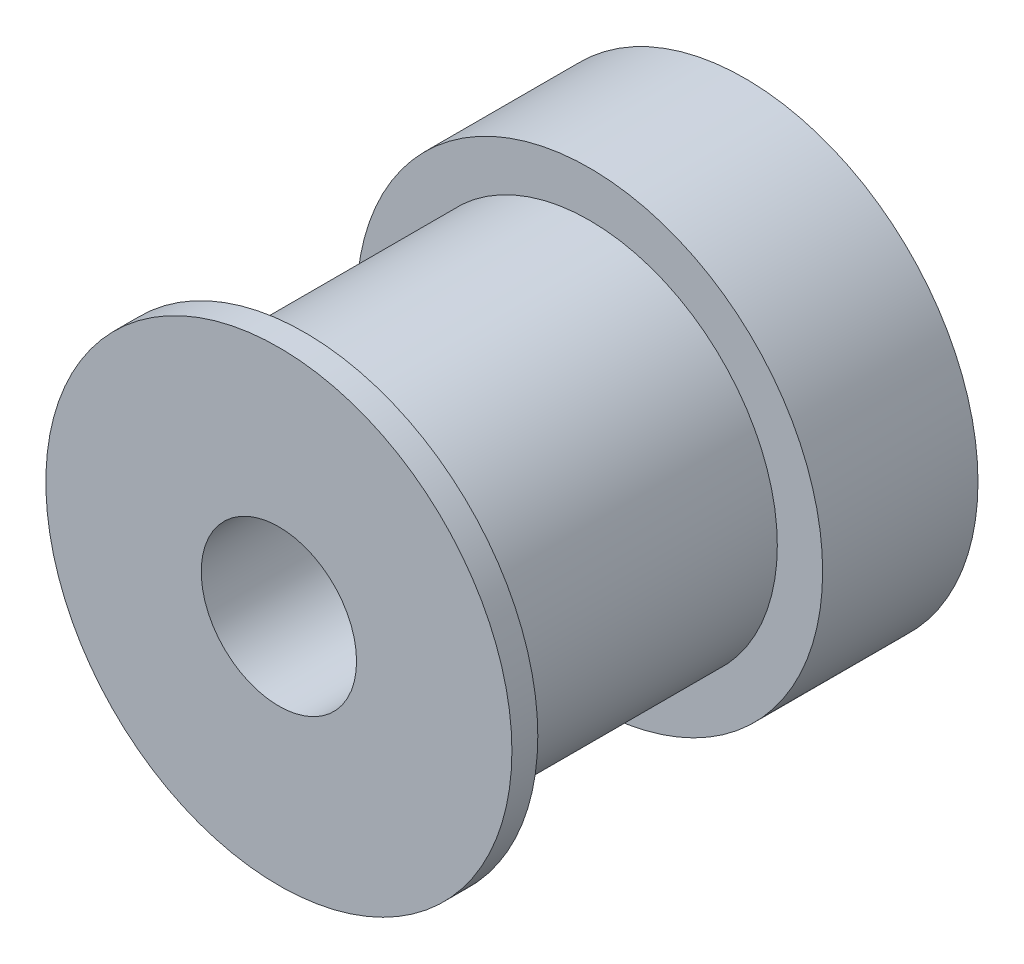
ISO-10303-21;
HEADER;
FILE_DESCRIPTION(('STEP AP214'),'2;1');
FILE_NAME('part.step','',(''),(''),'','','');
FILE_SCHEMA(('AUTOMOTIVE_DESIGN { 1 0 10303 214 1 1 1 1 }'));
ENDSEC;
DATA;
#1=APPLICATION_CONTEXT('core data for automotive mechanical design processes');
#2=APPLICATION_PROTOCOL_DEFINITION('international standard','automotive_design',2000,#1);
#3=PRODUCT_CONTEXT('',#1,'mechanical');
#4=PRODUCT('Part','Part','',(#3));
#5=PRODUCT_RELATED_PRODUCT_CATEGORY('part','',(#4));
#6=PRODUCT_DEFINITION_FORMATION('','',#4);
#7=PRODUCT_DEFINITION_CONTEXT('part definition',#1,'design');
#8=PRODUCT_DEFINITION('design','',#6,#7);
#9=PRODUCT_DEFINITION_SHAPE('','',#8);
#10=(LENGTH_UNIT() NAMED_UNIT(*) SI_UNIT(.MILLI.,.METRE.));
#11=(NAMED_UNIT(*) PLANE_ANGLE_UNIT() SI_UNIT($,.RADIAN.));
#12=(NAMED_UNIT(*) SI_UNIT($,.STERADIAN.) SOLID_ANGLE_UNIT());
#13=UNCERTAINTY_MEASURE_WITH_UNIT(LENGTH_MEASURE(1.E-05),#10,'distance_accuracy_value','');
#14=(GEOMETRIC_REPRESENTATION_CONTEXT(3) GLOBAL_UNCERTAINTY_ASSIGNED_CONTEXT((#13)) GLOBAL_UNIT_ASSIGNED_CONTEXT((#10,
#11,#12)) REPRESENTATION_CONTEXT('',''));
#15=CARTESIAN_POINT('',(0.,0.,0.));
#16=DIRECTION('',(0.,0.,1.));
#17=DIRECTION('',(1.,0.,0.));
#18=AXIS2_PLACEMENT_3D('',#15,#16,#17);
#19=CARTESIAN_POINT('',(0.,0.,6.));
#20=DIRECTION('',(0.,0.,1.));
#21=DIRECTION('',(1.,0.,0.));
#22=AXIS2_PLACEMENT_3D('',#19,#20,#21);
#23=PLANE('',#22);
#24=CARTESIAN_POINT('',(0.,0.,6.));
#25=DIRECTION('',(0.,0.,1.));
#26=DIRECTION('',(1.,0.,0.));
#27=AXIS2_PLACEMENT_3D('',#24,#25,#26);
#28=CIRCLE('',#27,7.25);
#29=CARTESIAN_POINT('',(7.25,0.,6.));
#30=VERTEX_POINT('',#29);
#31=EDGE_CURVE('E10',#30,#30,#28,.T.);
#32=ORIENTED_EDGE('',*,*,#31,.F.);
#33=EDGE_LOOP('',(#32));
#34=FACE_BOUND('',#33,.T.);
#35=CARTESIAN_POINT('',(0.,0.,6.));
#36=DIRECTION('',(0.,0.,1.));
#37=DIRECTION('',(1.,0.,0.));
#38=AXIS2_PLACEMENT_3D('',#35,#36,#37);
#39=CIRCLE('',#38,9.);
#40=CARTESIAN_POINT('',(9.,0.,6.));
#41=VERTEX_POINT('',#40);
#42=EDGE_CURVE('E48',#41,#41,#39,.T.);
#43=ORIENTED_EDGE('',*,*,#42,.T.);
#44=EDGE_LOOP('',(#43));
#45=FACE_BOUND('',#44,.T.);
#46=ADVANCED_FACE('F34',(#34,#45),#23,.T.);
#47=CARTESIAN_POINT('',(0.,0.,0.));
#48=DIRECTION('',(0.,0.,1.));
#49=DIRECTION('',(1.,0.,0.));
#50=AXIS2_PLACEMENT_3D('',#47,#48,#49);
#51=PLANE('',#50);
#52=CARTESIAN_POINT('',(0.,0.,0.));
#53=DIRECTION('',(0.,0.,1.));
#54=DIRECTION('',(1.,0.,0.));
#55=AXIS2_PLACEMENT_3D('',#52,#53,#54);
#56=CIRCLE('',#55,9.);
#57=CARTESIAN_POINT('',(9.,0.,0.));
#58=VERTEX_POINT('',#57);
#59=EDGE_CURVE('E53',#58,#58,#56,.T.);
#60=ORIENTED_EDGE('',*,*,#59,.F.);
#61=EDGE_LOOP('',(#60));
#62=FACE_BOUND('',#61,.T.);
#63=CARTESIAN_POINT('',(0.,0.,0.));
#64=DIRECTION('',(0.,0.,1.));
#65=DIRECTION('',(1.,0.,0.));
#66=AXIS2_PLACEMENT_3D('',#63,#64,#65);
#67=CIRCLE('',#66,3.);
#68=CARTESIAN_POINT('',(3.,0.,0.));
#69=VERTEX_POINT('',#68);
#70=EDGE_CURVE('E59',#69,#69,#67,.T.);
#71=ORIENTED_EDGE('',*,*,#70,.T.);
#72=EDGE_LOOP('',(#71));
#73=FACE_BOUND('',#72,.T.);
#74=ADVANCED_FACE('F65',(#62,#73),#51,.F.);
#75=CARTESIAN_POINT('',(0.,0.,6.));
#76=DIRECTION('',(0.,0.,-1.));
#77=DIRECTION('',(-1.,0.,0.));
#78=AXIS2_PLACEMENT_3D('',#75,#76,#77);
#79=CYLINDRICAL_SURFACE('',#78,9.);
#80=CARTESIAN_POINT('',(0.,-9.,5.5));
#81=CARTESIAN_POINT('',(0.0836345429749289,-8.99999856701294,5.49999664663131));
#82=CARTESIAN_POINT('',(0.167314729103293,-8.9988220674782,5.49298163501865));
#83=CARTESIAN_POINT('',(0.332328133003826,-8.99424206964832,5.46511860474081));
#84=CARTESIAN_POINT('',(0.413659120775548,-8.99083652354334,5.44425786585304));
#85=CARTESIAN_POINT('',(0.571562848327586,-8.9821804094187,5.38935073084435));
#86=CARTESIAN_POINT('',(0.64813942105914,-8.97693135095516,5.35531512061566));
#87=CARTESIAN_POINT('',(0.794485105186767,-8.96516536249242,5.27505262476856));
#88=CARTESIAN_POINT('',(0.864254993927155,-8.9586485775266,5.2288271335102));
#89=CARTESIAN_POINT('',(0.995683568575009,-8.94499990474988,5.12502694970772));
#90=CARTESIAN_POINT('',(1.05726774212098,-8.93786323088914,5.06735853121832));
#91=CARTESIAN_POINT('',(1.16993309919596,-8.92381576126039,4.94251121891631));
#92=CARTESIAN_POINT('',(1.22101361963458,-8.916904979776,4.87533172512603));
#93=CARTESIAN_POINT('',(1.31152027536308,-8.90404539455868,4.73285742028177));
#94=CARTESIAN_POINT('',(1.3508727317166,-8.89810277454982,4.65751519791714));
#95=CARTESIAN_POINT('',(1.41633501924673,-8.88791873876805,4.50117426141962));
#96=CARTESIAN_POINT('',(1.44244574493937,-8.88367720808584,4.42017592979342));
#97=CARTESIAN_POINT('',(1.48044862667088,-8.87742322105653,4.25561183508608));
#98=CARTESIAN_POINT('',(1.49246941748124,-8.8753906109142,4.17207655809916));
#99=CARTESIAN_POINT('',(1.50235003517393,-8.87372363361989,4.00415183386992));
#100=CARTESIAN_POINT('',(1.5002108642334,-8.87408909674328,3.91976244749962));
#101=CARTESIAN_POINT('',(1.48193705903769,-8.87715857318133,3.75344328323473));
#102=CARTESIAN_POINT('',(1.46594692913386,-8.8798384399135,3.67149711787286));
#103=CARTESIAN_POINT('',(1.42065188424207,-8.88719697126605,3.51146720930252));
#104=CARTESIAN_POINT('',(1.39134651259184,-8.89187570443963,3.43338359866687));
#105=CARTESIAN_POINT('',(1.32010634765635,-8.9027308760046,3.28286270593545));
#106=CARTESIAN_POINT('',(1.27811154832783,-8.90891440264395,3.21045435635126));
#107=CARTESIAN_POINT('',(1.18272721053446,-8.92207751049005,3.07365735967697));
#108=CARTESIAN_POINT('',(1.12933675239257,-8.92905715592572,3.00926936052704));
#109=CARTESIAN_POINT('',(1.01188932729543,-8.94313216727871,2.88950434851559));
#110=CARTESIAN_POINT('',(0.947708378323875,-8.95022789538991,2.83424888887595));
#111=CARTESIAN_POINT('',(0.810921149388987,-8.96365560838034,2.7352733424008));
#112=CARTESIAN_POINT('',(0.738314815143852,-8.96998758833847,2.69155332989006));
#113=CARTESIAN_POINT('',(0.586623549700026,-8.98118335735747,2.61687866371823));
#114=CARTESIAN_POINT('',(0.507533235338796,-8.98604591044468,2.58593474840125));
#115=CARTESIAN_POINT('',(0.345179007361638,-8.99374501807596,2.53780347085241));
#116=CARTESIAN_POINT('',(0.26191544350768,-8.99658174210284,2.52061495781577));
#117=CARTESIAN_POINT('',(0.0946259407809733,-8.99988677905612,2.50064718492332));
#118=CARTESIAN_POINT('',(0.010620442290606,-9.00038251807671,2.49770105691664));
#119=CARTESIAN_POINT('',(-0.156683863733933,-8.99902484652702,2.50585680665687));
#120=CARTESIAN_POINT('',(-0.239982698335224,-8.99717152634471,2.51695814388024));
#121=CARTESIAN_POINT('',(-0.402993705328059,-8.99134096162921,2.55275490960129));
#122=CARTESIAN_POINT('',(-0.482724521031229,-8.98737662880787,2.57736772503408));
#123=CARTESIAN_POINT('',(-0.636928130916266,-8.97776678673215,2.63940071091972));
#124=CARTESIAN_POINT('',(-0.711400629545832,-8.97212118307212,2.67682160058116));
#125=CARTESIAN_POINT('',(-0.853698413681376,-8.95970709781444,2.76379067481807));
#126=CARTESIAN_POINT('',(-0.92145915056229,-8.95292913532213,2.81344309370035));
#127=CARTESIAN_POINT('',(-1.04774615130161,-8.93903080435141,2.92332238923104));
#128=CARTESIAN_POINT('',(-1.10627174381795,-8.93191041102928,2.983550033966));
#129=CARTESIAN_POINT('',(-1.2130456677948,-8.91804105141507,3.11361852884285));
#130=CARTESIAN_POINT('',(-1.26118125666823,-8.91129669682264,3.18355249930865));
#131=CARTESIAN_POINT('',(-1.34502138617699,-8.8990291786673,3.33061178148312));
#132=CARTESIAN_POINT('',(-1.38072632086189,-8.89350597639612,3.4077368651365));
#133=CARTESIAN_POINT('',(-1.43852299888389,-8.88434072218623,3.56667383968728));
#134=CARTESIAN_POINT('',(-1.46067085952877,-8.88069092586639,3.64846485701829));
#135=CARTESIAN_POINT('',(-1.49090127226697,-8.87566630101156,3.81467207753306));
#136=CARTESIAN_POINT('',(-1.4989850471677,-8.87429127469633,3.89908805183923));
#137=CARTESIAN_POINT('',(-1.50082371962841,-8.87398039850407,4.06702309957745));
#138=CARTESIAN_POINT('',(-1.49475608167511,-8.8750143390339,4.15054022714517));
#139=CARTESIAN_POINT('',(-1.46884790337411,-8.87933868872237,4.31534754883046));
#140=CARTESIAN_POINT('',(-1.44900740766749,-8.88262909056728,4.39663775016512));
#141=CARTESIAN_POINT('',(-1.39618469375694,-8.89108413769031,4.55461506237557));
#142=CARTESIAN_POINT('',(-1.36321775436026,-8.89624660331802,4.63130740603362));
#143=CARTESIAN_POINT('',(-1.28509620234954,-8.90786621353324,4.77810140151691));
#144=CARTESIAN_POINT('',(-1.23994098524914,-8.91432342233039,4.84820272622328));
#145=CARTESIAN_POINT('',(-1.13809133062329,-8.92790072427373,4.98072134986465));
#146=CARTESIAN_POINT('',(-1.08126633815619,-8.93502777345781,5.04303761002017));
#147=CARTESIAN_POINT('',(-0.957965418828137,-8.94908623416505,5.15731096268496));
#148=CARTESIAN_POINT('',(-0.891487267747581,-8.95601760015928,5.2092656611829));
#149=CARTESIAN_POINT('',(-0.750221501784168,-8.96895917785332,5.30166896091997));
#150=CARTESIAN_POINT('',(-0.67537967251969,-8.97496269751862,5.34203562358777));
#151=CARTESIAN_POINT('',(-0.519907841627388,-8.98530700561065,5.40956169076595));
#152=CARTESIAN_POINT('',(-0.439283696898005,-8.98964944906489,5.43673424864782));
#153=CARTESIAN_POINT('',(-0.29862198602724,-8.99523474499773,5.471203164476));
#154=CARTESIAN_POINT('',(-0.239435298179068,-8.99701216364015,5.48198468176958));
#155=CARTESIAN_POINT('',(-0.120173586191886,-8.99939529591672,5.49638424270685));
#156=CARTESIAN_POINT('',(-0.0600985773650966,-9.00000102972385,5.50000240968242));
#157=CARTESIAN_POINT('',(0.,-9.,5.5));
#158=B_SPLINE_CURVE_WITH_KNOTS('',3,(#80,#81,#82,#83,#84,#85,#86,#87,#88,#89,#90,#91,#92,#93,
#94,#95,#96,#97,#98,#99,#100,#101,#102,#103,#104,#105,#106,#107,#108,#109,#110,#111,#112,#113,
#114,#115,#116,#117,#118,#119,#120,#121,#122,#123,#124,#125,#126,#127,#128,#129,#130,#131,#132,
#133,#134,#135,#136,#137,#138,#139,#140,#141,#142,#143,#144,#145,#146,#147,#148,#149,#150,#151,
#152,#153,#154,#155,#156,#157),.UNSPECIFIED.,.T.,.F.,(4,2,2,2,2,2,2,2,2,2,2,2,2,2,2,2,2,2,2,2,2,
2,2,2,2,2,2,2,2,2,2,2,2,2,2,2,2,2,4),(0.,0.250683950963106,0.501598527417252,0.752308120215162,
1.00298904760487,1.25581494637399,1.50865680101914,1.76305512494304,2.01743626125709,
2.26947646262054,2.52149882592532,2.77092313056245,3.02035599015229,3.27098733979534,
3.52163892408344,3.77539661946796,4.02915594981509,4.28312813349542,4.53707906712689,
4.78804730094838,5.03900587821516,5.28844684203849,5.5379018149564,5.78956095376214,
6.0412383783257,6.29552293204571,6.54979942425566,6.80301613405063,7.05621082671971,
7.3062474571362,7.5562832771288,7.80602890935734,8.05578693017602,8.30850830516035,
8.56128800327383,8.8158133896432,9.07008451278043,9.25022548898411,9.43036336366181),.UNSPECIFIED.);
#159=CARTESIAN_POINT('',(0.,-9.,5.5));
#160=VERTEX_POINT('',#159);
#161=EDGE_CURVE('E80',#160,#160,#158,.T.);
#162=ORIENTED_EDGE('',*,*,#161,.T.);
#163=EDGE_LOOP('',(#162));
#164=FACE_BOUND('',#163,.T.);
#165=ORIENTED_EDGE('',*,*,#42,.F.);
#166=EDGE_LOOP('',(#165));
#167=FACE_BOUND('',#166,.T.);
#168=ORIENTED_EDGE('',*,*,#59,.T.);
#169=EDGE_LOOP('',(#168));
#170=FACE_BOUND('',#169,.T.);
#171=ADVANCED_FACE('F36',(#164,#167,#170),#79,.T.);
#172=CARTESIAN_POINT('',(0.,0.,6.));
#173=DIRECTION('',(0.,0.,-1.));
#174=DIRECTION('',(-1.,0.,0.));
#175=AXIS2_PLACEMENT_3D('',#172,#173,#174);
#176=CYLINDRICAL_SURFACE('',#175,3.);
#177=CARTESIAN_POINT('',(0.,-3.,5.5));
#178=CARTESIAN_POINT('',(0.0788579444268502,-2.99999570107562,5.49999504652421));
#179=CARTESIAN_POINT('',(0.157809899546344,-2.99685736529635,5.49374489031842));
#180=CARTESIAN_POINT('',(0.313380352903344,-2.98461234055736,5.46902067948769));
#181=CARTESIAN_POINT('',(0.389994130070444,-2.97549431743379,5.45052341050328));
#182=CARTESIAN_POINT('',(0.538400317320673,-2.95224419105063,5.40220928707506));
#183=CARTESIAN_POINT('',(0.61021020440872,-2.93813158766306,5.37243642362805));
#184=CARTESIAN_POINT('',(0.747708925209898,-2.90618664773642,5.30264406795252));
#185=CARTESIAN_POINT('',(0.813398240985089,-2.88835460450288,5.2626253836267));
#186=CARTESIAN_POINT('',(0.941261726642864,-2.84934387387093,5.17072412577207));
#187=CARTESIAN_POINT('',(1.00298281668316,-2.82802798691306,5.11827028114054));
#188=CARTESIAN_POINT('',(1.11716916730047,-2.78489955370115,5.00421778112945));
#189=CARTESIAN_POINT('',(1.16962737466015,-2.76308664313552,4.94261222234134));
#190=CARTESIAN_POINT('',(1.26787800067542,-2.71948426796021,4.80627497571493));
#191=CARTESIAN_POINT('',(1.31283800332745,-2.69782780455198,4.73089585248113));
#192=CARTESIAN_POINT('',(1.38925234033604,-2.65928968158481,4.57244899602068));
#193=CARTESIAN_POINT('',(1.4207163224495,-2.64240461410484,4.48938680691588));
#194=CARTESIAN_POINT('',(1.46719866328288,-2.61686800556713,4.32300234186712));
#195=CARTESIAN_POINT('',(1.48308878562066,-2.6077840737557,4.23999332189891));
#196=CARTESIAN_POINT('',(1.50064048996327,-2.59772834922792,4.07203174333079));
#197=CARTESIAN_POINT('',(1.50231613255961,-2.59674854014932,3.98708118869327));
#198=CARTESIAN_POINT('',(1.49203093075844,-2.60266395385873,3.82857096352695));
#199=CARTESIAN_POINT('',(1.48167683930523,-2.6086314549302,3.75486395316542));
#200=CARTESIAN_POINT('',(1.4504097735854,-2.62614343100775,3.61041713594044));
#201=CARTESIAN_POINT('',(1.42949343584648,-2.63768968247664,3.53967828204203));
#202=CARTESIAN_POINT('',(1.37731467057901,-2.66531214619112,3.40115630115151));
#203=CARTESIAN_POINT('',(1.34582260067399,-2.68148760995998,3.33348040182132));
#204=CARTESIAN_POINT('',(1.273562531502,-2.71655106422106,3.20404856111499));
#205=CARTESIAN_POINT('',(1.2327903657187,-2.73544027170286,3.14229529659987));
#206=CARTESIAN_POINT('',(1.13709908236918,-2.77669736854929,3.01821812088516));
#207=CARTESIAN_POINT('',(1.08104168755392,-2.79920265355119,2.95681468963576));
#208=CARTESIAN_POINT('',(0.95933336811206,-2.84321434950611,2.84389687211365));
#209=CARTESIAN_POINT('',(0.893677884861428,-2.86472027938201,2.79238721194918));
#210=CARTESIAN_POINT('',(0.750774758747772,-2.90552980924446,2.69847150845541));
#211=CARTESIAN_POINT('',(0.673130387399113,-2.92468476243011,2.65659929133139));
#212=CARTESIAN_POINT('',(0.510699323233195,-2.95736821681863,2.58685445643549));
#213=CARTESIAN_POINT('',(0.425918364397913,-2.9709011841533,2.55897072247725));
#214=CARTESIAN_POINT('',(0.259149737491053,-2.98986500612153,2.52028689442499));
#215=CARTESIAN_POINT('',(0.177512295822489,-2.99587407451965,2.50826314637983));
#216=CARTESIAN_POINT('',(0.0131693999240275,-3.00109520188655,2.49780290329827));
#217=CARTESIAN_POINT('',(-0.069535529804863,-3.00031048081978,2.4993599715408));
#218=CARTESIAN_POINT('',(-0.22684945797898,-2.99236788380152,2.51531003262812));
#219=CARTESIAN_POINT('',(-0.301589112074895,-2.98570868532253,2.52869879909499));
#220=CARTESIAN_POINT('',(-0.447610338452911,-2.9673325697226,2.56635710784268));
#221=CARTESIAN_POINT('',(-0.51889152853663,-2.95561509501618,2.59062784968024));
#222=CARTESIAN_POINT('',(-0.658332912674359,-2.92776377120382,2.64999769964955));
#223=CARTESIAN_POINT('',(-0.726345595508704,-2.91151322654446,2.68538657517443));
#224=CARTESIAN_POINT('',(-0.855692042548907,-2.87615961476126,2.76566130346985));
#225=CARTESIAN_POINT('',(-0.917022944664887,-2.85705533350407,2.81055120189309));
#226=CARTESIAN_POINT('',(-1.03765153393382,-2.81562332004297,2.91364063799607));
#227=CARTESIAN_POINT('',(-1.09615811672854,-2.79316327265249,2.97271430266772));
#228=CARTESIAN_POINT('',(-1.20278448167828,-2.7489358741323,3.09988772691659));
#229=CARTESIAN_POINT('',(-1.25089707856781,-2.72716901100071,3.16799367827188));
#230=CARTESIAN_POINT('',(-1.33756187171853,-2.68576788309734,3.31546548125946));
#231=CARTESIAN_POINT('',(-1.37553824370037,-2.66628794383591,3.39521689914172));
#232=CARTESIAN_POINT('',(-1.43712423890206,-2.63361108441202,3.56126510136245));
#233=CARTESIAN_POINT('',(-1.46075237380052,-2.62040607332625,3.64755328970034));
#234=CARTESIAN_POINT('',(-1.49079253120031,-2.60342251538703,3.81536533432706));
#235=CARTESIAN_POINT('',(-1.49863949460818,-2.59886075197597,3.89655138015286));
#236=CARTESIAN_POINT('',(-1.5010337315643,-2.59748031962405,4.05917060074679));
#237=CARTESIAN_POINT('',(-1.49558676993486,-2.60065829439585,4.14060365310679));
#238=CARTESIAN_POINT('',(-1.47288918838996,-2.61356793076615,4.29322525230016));
#239=CARTESIAN_POINT('',(-1.45681247151455,-2.62264641723988,4.36465070521711));
#240=CARTESIAN_POINT('',(-1.41476303733662,-2.64556524281479,4.50371217913655));
#241=CARTESIAN_POINT('',(-1.38878713673988,-2.65940711354503,4.57134697313805));
#242=CARTESIAN_POINT('',(-1.32572361795085,-2.69142795546804,4.70593727647981));
#243=CARTESIAN_POINT('',(-1.28800670672355,-2.70983583593881,4.77254185274354));
#244=CARTESIAN_POINT('',(-1.20322645745609,-2.74852997452291,4.89891180427189));
#245=CARTESIAN_POINT('',(-1.15615825686234,-2.76881720693416,4.95867359578167));
#246=CARTESIAN_POINT('',(-1.04730498999206,-2.81193484737138,5.07721297353201));
#247=CARTESIAN_POINT('',(-0.984426634495892,-2.83477474959942,5.13498865352544));
#248=CARTESIAN_POINT('',(-0.849232209349796,-2.87816628389896,5.2393944751529));
#249=CARTESIAN_POINT('',(-0.776911084957796,-2.89871667939293,5.28601860920486));
#250=CARTESIAN_POINT('',(-0.623897395174418,-2.93547014349806,5.3668545440681));
#251=CARTESIAN_POINT('',(-0.543149255665096,-2.95164144740899,5.4009762538547));
#252=CARTESIAN_POINT('',(-0.37611315170713,-2.9775201194848,5.45471225163611));
#253=CARTESIAN_POINT('',(-0.28984169938365,-2.98724585044602,5.47436777020857));
#254=CARTESIAN_POINT('',(-0.168902919736342,-2.99543192870217,5.49084611662861));
#255=CARTESIAN_POINT('',(-0.135242819162346,-2.99714048010376,5.49427396129951));
#256=CARTESIAN_POINT('',(-0.0677275977076366,-2.99942545465223,5.49885199827113));
#257=CARTESIAN_POINT('',(-0.0338724714699423,-3.00000184655071,5.50000212770531));
#258=CARTESIAN_POINT('',(0.,-3.,5.5));
#259=B_SPLINE_CURVE_WITH_KNOTS('',3,(#177,#178,#179,#180,#181,#182,#183,#184,#185,#186,#187,
#188,#189,#190,#191,#192,#193,#194,#195,#196,#197,#198,#199,#200,#201,#202,#203,#204,#205,#206,
#207,#208,#209,#210,#211,#212,#213,#214,#215,#216,#217,#218,#219,#220,#221,#222,#223,#224,#225,
#226,#227,#228,#229,#230,#231,#232,#233,#234,#235,#236,#237,#238,#239,#240,#241,#242,#243,#244,
#245,#246,#247,#248,#249,#250,#251,#252,#253,#254,#255,#256,#257,#258),.UNSPECIFIED.,.T.,.F.,(4,
2,2,2,2,2,2,2,2,2,2,2,2,2,2,2,2,2,2,2,2,2,2,2,2,2,2,2,2,2,2,2,2,2,2,2,2,2,2,2,4),(0.,
0.236436386130439,0.473322224563796,0.709293233238448,0.945245640872351,1.19547263807713,
1.44588935648105,1.71572589646129,1.98536921847421,2.23887018210344,2.49212035993531,
2.71508568613981,2.93812205888518,3.16635360252731,3.39468781890333,3.65197412000818,
3.9093830189803,4.17874533321661,4.44789325368419,4.69474935707018,4.94148846767214,
5.16910359759183,5.39674382446397,5.63089284041848,5.86514176122509,6.12239415966628,
6.37982382923148,6.64972023242589,6.91926767918176,7.1629396125457,7.40650589797017,
7.62686895373284,7.84730293182527,8.08254685170431,8.31791341715446,8.58187864135757,
8.84598575071869,9.1119602049529,9.37717362931724,9.47872920200875,9.58028757766599),.UNSPECIFIED.);
#260=CARTESIAN_POINT('',(0.,-3.,5.5));
#261=VERTEX_POINT('',#260);
#262=EDGE_CURVE('E39',#261,#261,#259,.T.);
#263=ORIENTED_EDGE('',*,*,#262,.F.);
#264=EDGE_LOOP('',(#263));
#265=FACE_BOUND('',#264,.T.);
#266=ORIENTED_EDGE('',*,*,#70,.F.);
#267=EDGE_LOOP('',(#266));
#268=FACE_BOUND('',#267,.T.);
#269=CARTESIAN_POINT('',(0.,0.,18.));
#270=DIRECTION('',(0.,0.,1.));
#271=DIRECTION('',(1.,0.,0.));
#272=AXIS2_PLACEMENT_3D('',#269,#270,#271);
#273=CIRCLE('',#272,3.);
#274=CARTESIAN_POINT('',(3.,0.,18.));
#275=VERTEX_POINT('',#274);
#276=EDGE_CURVE('E77',#275,#275,#273,.T.);
#277=ORIENTED_EDGE('',*,*,#276,.T.);
#278=EDGE_LOOP('',(#277));
#279=FACE_BOUND('',#278,.T.);
#280=ADVANCED_FACE('F70',(#265,#268,#279),#176,.F.);
#281=CARTESIAN_POINT('',(0.,0.,17.));
#282=DIRECTION('',(0.,0.,-1.));
#283=DIRECTION('',(-1.,0.,0.));
#284=AXIS2_PLACEMENT_3D('',#281,#282,#283);
#285=CYLINDRICAL_SURFACE('',#284,7.25);
#286=CARTESIAN_POINT('',(0.,0.,17.));
#287=DIRECTION('',(0.,0.,1.));
#288=DIRECTION('',(1.,0.,0.));
#289=AXIS2_PLACEMENT_3D('',#286,#287,#288);
#290=CIRCLE('',#289,7.25);
#291=CARTESIAN_POINT('',(7.25,0.,17.));
#292=VERTEX_POINT('',#291);
#293=EDGE_CURVE('E57',#292,#292,#290,.T.);
#294=ORIENTED_EDGE('',*,*,#293,.F.);
#295=EDGE_LOOP('',(#294));
#296=FACE_BOUND('',#295,.T.);
#297=ORIENTED_EDGE('',*,*,#31,.T.);
#298=EDGE_LOOP('',(#297));
#299=FACE_BOUND('',#298,.T.);
#300=ADVANCED_FACE('F73',(#296,#299),#285,.T.);
#301=CARTESIAN_POINT('',(0.,0.,18.));
#302=DIRECTION('',(0.,0.,1.));
#303=DIRECTION('',(1.,0.,0.));
#304=AXIS2_PLACEMENT_3D('',#301,#302,#303);
#305=PLANE('',#304);
#306=CARTESIAN_POINT('',(0.,0.,18.));
#307=DIRECTION('',(0.,0.,1.));
#308=DIRECTION('',(1.,0.,0.));
#309=AXIS2_PLACEMENT_3D('',#306,#307,#308);
#310=CIRCLE('',#309,9.);
#311=CARTESIAN_POINT('',(9.,0.,18.));
#312=VERTEX_POINT('',#311);
#313=EDGE_CURVE('E83',#312,#312,#310,.T.);
#314=ORIENTED_EDGE('',*,*,#313,.T.);
#315=EDGE_LOOP('',(#314));
#316=FACE_BOUND('',#315,.T.);
#317=ORIENTED_EDGE('',*,*,#276,.F.);
#318=EDGE_LOOP('',(#317));
#319=FACE_BOUND('',#318,.T.);
#320=ADVANCED_FACE('F100',(#316,#319),#305,.T.);
#321=CARTESIAN_POINT('',(0.,0.,17.));
#322=DIRECTION('',(0.,0.,1.));
#323=DIRECTION('',(1.,0.,0.));
#324=AXIS2_PLACEMENT_3D('',#321,#322,#323);
#325=PLANE('',#324);
#326=ORIENTED_EDGE('',*,*,#293,.T.);
#327=EDGE_LOOP('',(#326));
#328=FACE_BOUND('',#327,.T.);
#329=CARTESIAN_POINT('',(0.,0.,17.));
#330=DIRECTION('',(0.,0.,1.));
#331=DIRECTION('',(1.,0.,0.));
#332=AXIS2_PLACEMENT_3D('',#329,#330,#331);
#333=CIRCLE('',#332,9.);
#334=CARTESIAN_POINT('',(9.,0.,17.));
#335=VERTEX_POINT('',#334);
#336=EDGE_CURVE('E79',#335,#335,#333,.T.);
#337=ORIENTED_EDGE('',*,*,#336,.F.);
#338=EDGE_LOOP('',(#337));
#339=FACE_BOUND('',#338,.T.);
#340=ADVANCED_FACE('F96',(#328,#339),#325,.F.);
#341=CARTESIAN_POINT('',(0.,0.,18.));
#342=DIRECTION('',(0.,0.,-1.));
#343=DIRECTION('',(-1.,0.,0.));
#344=AXIS2_PLACEMENT_3D('',#341,#342,#343);
#345=CYLINDRICAL_SURFACE('',#344,9.);
#346=ORIENTED_EDGE('',*,*,#313,.F.);
#347=EDGE_LOOP('',(#346));
#348=FACE_BOUND('',#347,.T.);
#349=ORIENTED_EDGE('',*,*,#336,.T.);
#350=EDGE_LOOP('',(#349));
#351=FACE_BOUND('',#350,.T.);
#352=ADVANCED_FACE('F124',(#348,#351),#345,.T.);
#353=CARTESIAN_POINT('',(0.,-9.,4.));
#354=DIRECTION('',(0.,1.,0.));
#355=DIRECTION('',(0.,0.,1.));
#356=AXIS2_PLACEMENT_3D('',#353,#354,#355);
#357=CYLINDRICAL_SURFACE('',#356,1.5);
#358=ORIENTED_EDGE('',*,*,#262,.T.);
#359=EDGE_LOOP('',(#358));
#360=FACE_BOUND('',#359,.T.);
#361=ORIENTED_EDGE('',*,*,#161,.F.);
#362=EDGE_LOOP('',(#361));
#363=FACE_BOUND('',#362,.T.);
#364=ADVANCED_FACE('F122',(#360,#363),#357,.F.);
#365=CLOSED_SHELL('',(#46,#74,#171,#280,#300,#320,#340,#352,#364));
#366=MANIFOLD_SOLID_BREP('B2',#365);
#367=ADVANCED_BREP_SHAPE_REPRESENTATION('',(#18,#366),#14);
#368=SHAPE_DEFINITION_REPRESENTATION(#9,#367);
ENDSEC;
END-ISO-10303-21;
